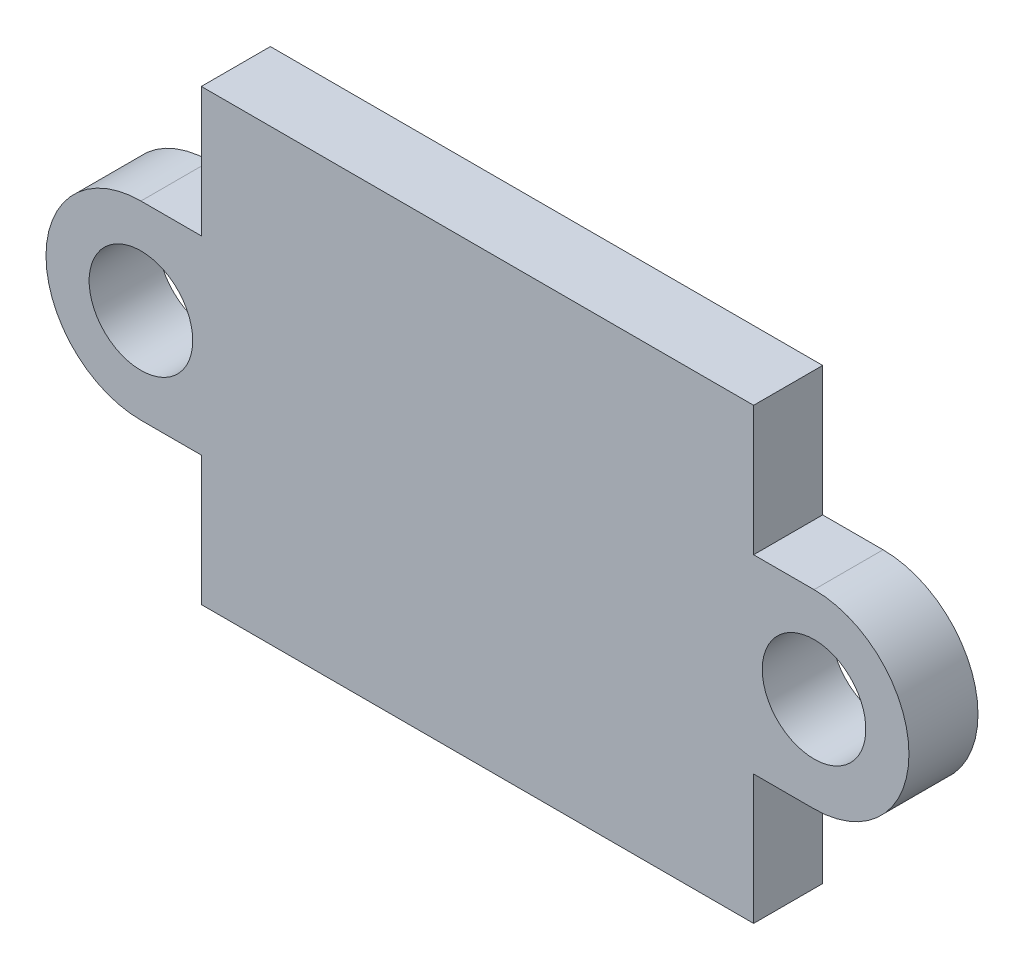
ISO-10303-21;
HEADER;
FILE_DESCRIPTION(('STEP AP214'),'2;1');
FILE_NAME('part.step','',(''),(''),'','','');
FILE_SCHEMA(('AUTOMOTIVE_DESIGN { 1 0 10303 214 1 1 1 1 }'));
ENDSEC;
DATA;
#1=APPLICATION_CONTEXT('core data for automotive mechanical design processes');
#2=APPLICATION_PROTOCOL_DEFINITION('international standard','automotive_design',2000,#1);
#3=PRODUCT_CONTEXT('',#1,'mechanical');
#4=PRODUCT('Part','Part','',(#3));
#5=PRODUCT_RELATED_PRODUCT_CATEGORY('part','',(#4));
#6=PRODUCT_DEFINITION_FORMATION('','',#4);
#7=PRODUCT_DEFINITION_CONTEXT('part definition',#1,'design');
#8=PRODUCT_DEFINITION('design','',#6,#7);
#9=PRODUCT_DEFINITION_SHAPE('','',#8);
#10=(LENGTH_UNIT() NAMED_UNIT(*) SI_UNIT(.MILLI.,.METRE.));
#11=(NAMED_UNIT(*) PLANE_ANGLE_UNIT() SI_UNIT($,.RADIAN.));
#12=(NAMED_UNIT(*) SI_UNIT($,.STERADIAN.) SOLID_ANGLE_UNIT());
#13=UNCERTAINTY_MEASURE_WITH_UNIT(LENGTH_MEASURE(1.E-05),#10,'distance_accuracy_value','');
#14=(GEOMETRIC_REPRESENTATION_CONTEXT(3) GLOBAL_UNCERTAINTY_ASSIGNED_CONTEXT((#13)) GLOBAL_UNIT_ASSIGNED_CONTEXT((#10,
#11,#12)) REPRESENTATION_CONTEXT('',''));
#15=CARTESIAN_POINT('',(0.,0.,0.));
#16=DIRECTION('',(0.,0.,1.));
#17=DIRECTION('',(1.,0.,0.));
#18=AXIS2_PLACEMENT_3D('',#15,#16,#17);
#19=CARTESIAN_POINT('',(-7.99999999999997,-6.50000000000001,1.));
#20=DIRECTION('',(1.,0.,0.));
#21=DIRECTION('',(0.,0.,-1.));
#22=AXIS2_PLACEMENT_3D('',#19,#20,#21);
#23=PLANE('',#22);
#24=DIRECTION('',(0.,0.,-1.));
#25=VECTOR('',#24,1.);
#26=CARTESIAN_POINT('',(-7.99999999999997,2.75,1.));
#27=LINE('',#26,#25);
#28=CARTESIAN_POINT('',(-7.99999999999997,2.75,1.));
#29=VERTEX_POINT('',#28);
#30=CARTESIAN_POINT('',(-7.99999999999997,2.75,-1.));
#31=VERTEX_POINT('',#30);
#32=EDGE_CURVE('E153',#29,#31,#27,.T.);
#33=ORIENTED_EDGE('',*,*,#32,.F.);
#34=DIRECTION('',(0.,-1.,0.));
#35=VECTOR('',#34,1.);
#36=CARTESIAN_POINT('',(-7.99999999999997,-6.50000000000001,1.));
#37=LINE('',#36,#35);
#38=CARTESIAN_POINT('',(-7.99999999999997,6.49999999999998,1.));
#39=VERTEX_POINT('',#38);
#40=EDGE_CURVE('E182',#39,#29,#37,.T.);
#41=ORIENTED_EDGE('',*,*,#40,.F.);
#42=DIRECTION('',(0.,0.,-1.));
#43=VECTOR('',#42,1.);
#44=CARTESIAN_POINT('',(-7.99999999999997,6.49999999999998,1.));
#45=LINE('',#44,#43);
#46=CARTESIAN_POINT('',(-7.99999999999997,6.49999999999998,-1.));
#47=VERTEX_POINT('',#46);
#48=EDGE_CURVE('E193',#39,#47,#45,.T.);
#49=ORIENTED_EDGE('',*,*,#48,.T.);
#50=DIRECTION('',(0.,-1.,0.));
#51=VECTOR('',#50,1.);
#52=CARTESIAN_POINT('',(-7.99999999999997,-6.50000000000001,-1.));
#53=LINE('',#52,#51);
#54=EDGE_CURVE('E194',#47,#31,#53,.T.);
#55=ORIENTED_EDGE('',*,*,#54,.T.);
#56=EDGE_LOOP('',(#33,#41,#49,#55));
#57=FACE_BOUND('',#56,.T.);
#58=ADVANCED_FACE('F36',(#57),#23,.F.);
#59=CARTESIAN_POINT('',(8.00000000000003,-6.50000000000001,1.));
#60=DIRECTION('',(-1.,0.,0.));
#61=DIRECTION('',(0.,0.,1.));
#62=AXIS2_PLACEMENT_3D('',#59,#60,#61);
#63=PLANE('',#62);
#64=DIRECTION('',(0.,0.,-1.));
#65=VECTOR('',#64,1.);
#66=CARTESIAN_POINT('',(7.99999999999997,-2.75,1.));
#67=LINE('',#66,#65);
#68=CARTESIAN_POINT('',(7.99999999999997,-2.75,1.));
#69=VERTEX_POINT('',#68);
#70=CARTESIAN_POINT('',(7.99999999999997,-2.75,-1.));
#71=VERTEX_POINT('',#70);
#72=EDGE_CURVE('E175',#69,#71,#67,.T.);
#73=ORIENTED_EDGE('',*,*,#72,.F.);
#74=DIRECTION('',(0.,1.,0.));
#75=VECTOR('',#74,1.);
#76=CARTESIAN_POINT('',(8.00000000000003,-6.50000000000001,1.));
#77=LINE('',#76,#75);
#78=CARTESIAN_POINT('',(8.00000000000003,-6.50000000000001,1.));
#79=VERTEX_POINT('',#78);
#80=EDGE_CURVE('E188',#79,#69,#77,.T.);
#81=ORIENTED_EDGE('',*,*,#80,.F.);
#82=DIRECTION('',(0.,0.,-1.));
#83=VECTOR('',#82,1.);
#84=CARTESIAN_POINT('',(8.00000000000003,-6.50000000000001,1.));
#85=LINE('',#84,#83);
#86=CARTESIAN_POINT('',(8.00000000000003,-6.50000000000001,-1.));
#87=VERTEX_POINT('',#86);
#88=EDGE_CURVE('E44',#79,#87,#85,.T.);
#89=ORIENTED_EDGE('',*,*,#88,.T.);
#90=DIRECTION('',(0.,1.,0.));
#91=VECTOR('',#90,1.);
#92=CARTESIAN_POINT('',(8.00000000000003,-6.50000000000001,-1.));
#93=LINE('',#92,#91);
#94=EDGE_CURVE('E200',#87,#71,#93,.T.);
#95=ORIENTED_EDGE('',*,*,#94,.T.);
#96=EDGE_LOOP('',(#73,#81,#89,#95));
#97=FACE_BOUND('',#96,.T.);
#98=ADVANCED_FACE('F215',(#97),#63,.F.);
#99=CARTESIAN_POINT('',(-7.99999999999997,-2.75,1.));
#100=VERTEX_POINT('',#99);
#101=CARTESIAN_POINT('',(-7.99999999999997,-6.50000000000001,1.));
#102=VERTEX_POINT('',#101);
#103=EDGE_CURVE('E185',#100,#102,#37,.T.);
#104=ORIENTED_EDGE('',*,*,#103,.F.);
#105=DIRECTION('',(0.,0.,-1.));
#106=VECTOR('',#105,1.);
#107=CARTESIAN_POINT('',(-7.99999999999997,-2.75,1.));
#108=LINE('',#107,#106);
#109=CARTESIAN_POINT('',(-7.99999999999997,-2.75,-1.));
#110=VERTEX_POINT('',#109);
#111=EDGE_CURVE('E130',#100,#110,#108,.T.);
#112=ORIENTED_EDGE('',*,*,#111,.T.);
#113=CARTESIAN_POINT('',(-7.99999999999997,-6.50000000000001,-1.));
#114=VERTEX_POINT('',#113);
#115=EDGE_CURVE('E181',#110,#114,#53,.T.);
#116=ORIENTED_EDGE('',*,*,#115,.T.);
#117=DIRECTION('',(0.,0.,-1.));
#118=VECTOR('',#117,1.);
#119=CARTESIAN_POINT('',(-7.99999999999997,-6.50000000000001,1.));
#120=LINE('',#119,#118);
#121=EDGE_CURVE('E11',#102,#114,#120,.T.);
#122=ORIENTED_EDGE('',*,*,#121,.F.);
#123=EDGE_LOOP('',(#104,#112,#116,#122));
#124=FACE_BOUND('',#123,.T.);
#125=ADVANCED_FACE('F38',(#124),#23,.F.);
#126=CARTESIAN_POINT('',(8.00000000000003,-6.50000000000001,1.));
#127=DIRECTION('',(0.,1.,0.));
#128=DIRECTION('',(0.,0.,1.));
#129=AXIS2_PLACEMENT_3D('',#126,#127,#128);
#130=PLANE('',#129);
#131=DIRECTION('',(1.,0.,0.));
#132=VECTOR('',#131,1.);
#133=CARTESIAN_POINT('',(8.00000000000003,-6.50000000000001,-1.));
#134=LINE('',#133,#132);
#135=EDGE_CURVE('E197',#114,#87,#134,.T.);
#136=ORIENTED_EDGE('',*,*,#135,.T.);
#137=ORIENTED_EDGE('',*,*,#88,.F.);
#138=DIRECTION('',(1.,0.,0.));
#139=VECTOR('',#138,1.);
#140=CARTESIAN_POINT('',(8.00000000000003,-6.50000000000001,1.));
#141=LINE('',#140,#139);
#142=EDGE_CURVE('E184',#102,#79,#141,.T.);
#143=ORIENTED_EDGE('',*,*,#142,.F.);
#144=ORIENTED_EDGE('',*,*,#121,.T.);
#145=EDGE_LOOP('',(#136,#137,#143,#144));
#146=FACE_BOUND('',#145,.T.);
#147=ADVANCED_FACE('F234',(#146),#130,.F.);
#148=CARTESIAN_POINT('',(7.99999999999997,2.75,1.));
#149=VERTEX_POINT('',#148);
#150=CARTESIAN_POINT('',(8.00000000000003,6.49999999999998,1.));
#151=VERTEX_POINT('',#150);
#152=EDGE_CURVE('E187',#149,#151,#77,.T.);
#153=ORIENTED_EDGE('',*,*,#152,.F.);
#154=DIRECTION('',(0.,0.,-1.));
#155=VECTOR('',#154,1.);
#156=CARTESIAN_POINT('',(7.99999999999997,2.75,1.));
#157=LINE('',#156,#155);
#158=CARTESIAN_POINT('',(8.00000000000003,2.75,-1.));
#159=VERTEX_POINT('',#158);
#160=EDGE_CURVE('E177',#149,#159,#157,.T.);
#161=ORIENTED_EDGE('',*,*,#160,.T.);
#162=CARTESIAN_POINT('',(8.00000000000003,6.49999999999998,-1.));
#163=VERTEX_POINT('',#162);
#164=EDGE_CURVE('E199',#159,#163,#93,.T.);
#165=ORIENTED_EDGE('',*,*,#164,.T.);
#166=DIRECTION('',(0.,0.,-1.));
#167=VECTOR('',#166,1.);
#168=CARTESIAN_POINT('',(8.00000000000003,6.49999999999998,1.));
#169=LINE('',#168,#167);
#170=EDGE_CURVE('E207',#151,#163,#169,.T.);
#171=ORIENTED_EDGE('',*,*,#170,.F.);
#172=EDGE_LOOP('',(#153,#161,#165,#171));
#173=FACE_BOUND('',#172,.T.);
#174=ADVANCED_FACE('F258',(#173),#63,.F.);
#175=CARTESIAN_POINT('',(8.00000000000003,6.49999999999998,1.));
#176=DIRECTION('',(0.,-1.,0.));
#177=DIRECTION('',(1.,0.,0.));
#178=AXIS2_PLACEMENT_3D('',#175,#176,#177);
#179=PLANE('',#178);
#180=DIRECTION('',(-1.,0.,0.));
#181=VECTOR('',#180,1.);
#182=CARTESIAN_POINT('',(8.00000000000003,6.49999999999998,-1.));
#183=LINE('',#182,#181);
#184=EDGE_CURVE('E203',#163,#47,#183,.T.);
#185=ORIENTED_EDGE('',*,*,#184,.T.);
#186=ORIENTED_EDGE('',*,*,#48,.F.);
#187=DIRECTION('',(-1.,0.,0.));
#188=VECTOR('',#187,1.);
#189=CARTESIAN_POINT('',(8.00000000000003,6.49999999999998,1.));
#190=LINE('',#189,#188);
#191=EDGE_CURVE('E191',#151,#39,#190,.T.);
#192=ORIENTED_EDGE('',*,*,#191,.F.);
#193=ORIENTED_EDGE('',*,*,#170,.T.);
#194=EDGE_LOOP('',(#185,#186,#192,#193));
#195=FACE_BOUND('',#194,.T.);
#196=ADVANCED_FACE('F253',(#195),#179,.F.);
#197=CARTESIAN_POINT('',(0.,0.,1.));
#198=DIRECTION('',(0.,0.,1.));
#199=DIRECTION('',(1.,0.,0.));
#200=AXIS2_PLACEMENT_3D('',#197,#198,#199);
#201=PLANE('',#200);
#202=ORIENTED_EDGE('',*,*,#40,.T.);
#203=DIRECTION('',(-1.,0.,0.));
#204=VECTOR('',#203,1.);
#205=CARTESIAN_POINT('',(-9.75,2.75,1.));
#206=LINE('',#205,#204);
#207=CARTESIAN_POINT('',(-9.75,2.75,1.));
#208=VERTEX_POINT('',#207);
#209=EDGE_CURVE('E133',#29,#208,#206,.T.);
#210=ORIENTED_EDGE('',*,*,#209,.T.);
#211=CARTESIAN_POINT('',(-9.75,0.,1.));
#212=DIRECTION('',(0.,0.,1.));
#213=DIRECTION('',(1.,0.,0.));
#214=AXIS2_PLACEMENT_3D('',#211,#212,#213);
#215=CIRCLE('',#214,2.75);
#216=CARTESIAN_POINT('',(-9.75,-2.75,1.));
#217=VERTEX_POINT('',#216);
#218=EDGE_CURVE('E134',#208,#217,#215,.T.);
#219=ORIENTED_EDGE('',*,*,#218,.T.);
#220=DIRECTION('',(1.,0.,0.));
#221=VECTOR('',#220,1.);
#222=CARTESIAN_POINT('',(-9.75,-2.75,1.));
#223=LINE('',#222,#221);
#224=EDGE_CURVE('E124',#217,#100,#223,.T.);
#225=ORIENTED_EDGE('',*,*,#224,.T.);
#226=ORIENTED_EDGE('',*,*,#103,.T.);
#227=ORIENTED_EDGE('',*,*,#142,.T.);
#228=ORIENTED_EDGE('',*,*,#80,.T.);
#229=DIRECTION('',(1.,0.,0.));
#230=VECTOR('',#229,1.);
#231=CARTESIAN_POINT('',(9.75,-2.75,1.));
#232=LINE('',#231,#230);
#233=CARTESIAN_POINT('',(9.75,-2.75,1.));
#234=VERTEX_POINT('',#233);
#235=EDGE_CURVE('E166',#69,#234,#232,.T.);
#236=ORIENTED_EDGE('',*,*,#235,.T.);
#237=CARTESIAN_POINT('',(9.75,0.,1.));
#238=DIRECTION('',(0.,0.,1.));
#239=DIRECTION('',(-1.,0.,0.));
#240=AXIS2_PLACEMENT_3D('',#237,#238,#239);
#241=CIRCLE('',#240,2.75);
#242=CARTESIAN_POINT('',(9.75,2.75,1.));
#243=VERTEX_POINT('',#242);
#244=EDGE_CURVE('E160',#234,#243,#241,.T.);
#245=ORIENTED_EDGE('',*,*,#244,.T.);
#246=DIRECTION('',(-1.,0.,0.));
#247=VECTOR('',#246,1.);
#248=CARTESIAN_POINT('',(9.75,2.75,1.));
#249=LINE('',#248,#247);
#250=EDGE_CURVE('E163',#243,#149,#249,.T.);
#251=ORIENTED_EDGE('',*,*,#250,.T.);
#252=ORIENTED_EDGE('',*,*,#152,.T.);
#253=ORIENTED_EDGE('',*,*,#191,.T.);
#254=EDGE_LOOP('',(#202,#210,#219,#225,#226,#227,#228,#236,#245,#251,#252,#253));
#255=FACE_BOUND('',#254,.T.);
#256=CARTESIAN_POINT('',(9.75,0.,1.));
#257=DIRECTION('',(0.,0.,1.));
#258=DIRECTION('',(-1.,0.,0.));
#259=AXIS2_PLACEMENT_3D('',#256,#257,#258);
#260=CIRCLE('',#259,1.5);
#261=CARTESIAN_POINT('',(8.25,0.,1.));
#262=VERTEX_POINT('',#261);
#263=EDGE_CURVE('E151',#262,#262,#260,.T.);
#264=ORIENTED_EDGE('',*,*,#263,.F.);
#265=EDGE_LOOP('',(#264));
#266=FACE_BOUND('',#265,.T.);
#267=CARTESIAN_POINT('',(-9.75,0.,1.));
#268=DIRECTION('',(0.,0.,1.));
#269=DIRECTION('',(1.,0.,0.));
#270=AXIS2_PLACEMENT_3D('',#267,#268,#269);
#271=CIRCLE('',#270,1.5);
#272=CARTESIAN_POINT('',(-8.25,0.,1.));
#273=VERTEX_POINT('',#272);
#274=EDGE_CURVE('E239',#273,#273,#271,.T.);
#275=ORIENTED_EDGE('',*,*,#274,.F.);
#276=EDGE_LOOP('',(#275));
#277=FACE_BOUND('',#276,.T.);
#278=ADVANCED_FACE('F138',(#255,#266,#277),#201,.T.);
#279=CARTESIAN_POINT('',(0.,0.,-1.));
#280=DIRECTION('',(0.,0.,1.));
#281=DIRECTION('',(1.,0.,0.));
#282=AXIS2_PLACEMENT_3D('',#279,#280,#281);
#283=PLANE('',#282);
#284=ORIENTED_EDGE('',*,*,#54,.F.);
#285=ORIENTED_EDGE('',*,*,#184,.F.);
#286=ORIENTED_EDGE('',*,*,#164,.F.);
#287=DIRECTION('',(-1.,0.,0.));
#288=VECTOR('',#287,1.);
#289=CARTESIAN_POINT('',(9.75,2.75,-1.));
#290=LINE('',#289,#288);
#291=CARTESIAN_POINT('',(9.75,2.75,-1.));
#292=VERTEX_POINT('',#291);
#293=EDGE_CURVE('E59',#292,#159,#290,.T.);
#294=ORIENTED_EDGE('',*,*,#293,.F.);
#295=CARTESIAN_POINT('',(9.75,0.,-1.));
#296=DIRECTION('',(0.,0.,1.));
#297=DIRECTION('',(-1.,0.,0.));
#298=AXIS2_PLACEMENT_3D('',#295,#296,#297);
#299=CIRCLE('',#298,2.75);
#300=CARTESIAN_POINT('',(9.75,-2.75,-1.));
#301=VERTEX_POINT('',#300);
#302=EDGE_CURVE('E158',#301,#292,#299,.T.);
#303=ORIENTED_EDGE('',*,*,#302,.F.);
#304=DIRECTION('',(1.,0.,0.));
#305=VECTOR('',#304,1.);
#306=CARTESIAN_POINT('',(9.75,-2.75,-1.));
#307=LINE('',#306,#305);
#308=EDGE_CURVE('E164',#71,#301,#307,.T.);
#309=ORIENTED_EDGE('',*,*,#308,.F.);
#310=ORIENTED_EDGE('',*,*,#94,.F.);
#311=ORIENTED_EDGE('',*,*,#135,.F.);
#312=ORIENTED_EDGE('',*,*,#115,.F.);
#313=DIRECTION('',(1.,0.,0.));
#314=VECTOR('',#313,1.);
#315=CARTESIAN_POINT('',(-9.75,-2.75,-1.));
#316=LINE('',#315,#314);
#317=CARTESIAN_POINT('',(-9.75,-2.75,-1.));
#318=VERTEX_POINT('',#317);
#319=EDGE_CURVE('E51',#318,#110,#316,.T.);
#320=ORIENTED_EDGE('',*,*,#319,.F.);
#321=CARTESIAN_POINT('',(-9.75,0.,-1.));
#322=DIRECTION('',(0.,0.,1.));
#323=DIRECTION('',(1.,0.,0.));
#324=AXIS2_PLACEMENT_3D('',#321,#322,#323);
#325=CIRCLE('',#324,2.75);
#326=CARTESIAN_POINT('',(-9.75,2.75,-1.));
#327=VERTEX_POINT('',#326);
#328=EDGE_CURVE('E147',#327,#318,#325,.T.);
#329=ORIENTED_EDGE('',*,*,#328,.F.);
#330=DIRECTION('',(-1.,0.,0.));
#331=VECTOR('',#330,1.);
#332=CARTESIAN_POINT('',(-9.75,2.75,-1.));
#333=LINE('',#332,#331);
#334=EDGE_CURVE('E143',#31,#327,#333,.T.);
#335=ORIENTED_EDGE('',*,*,#334,.F.);
#336=EDGE_LOOP('',(#284,#285,#286,#294,#303,#309,#310,#311,#312,#320,#329,#335));
#337=FACE_BOUND('',#336,.T.);
#338=CARTESIAN_POINT('',(9.75,0.,-1.));
#339=DIRECTION('',(0.,0.,1.));
#340=DIRECTION('',(-1.,0.,0.));
#341=AXIS2_PLACEMENT_3D('',#338,#339,#340);
#342=CIRCLE('',#341,1.5);
#343=CARTESIAN_POINT('',(8.25,0.,-1.));
#344=VERTEX_POINT('',#343);
#345=EDGE_CURVE('E148',#344,#344,#342,.T.);
#346=ORIENTED_EDGE('',*,*,#345,.T.);
#347=EDGE_LOOP('',(#346));
#348=FACE_BOUND('',#347,.T.);
#349=CARTESIAN_POINT('',(-9.75,0.,-1.));
#350=DIRECTION('',(0.,0.,1.));
#351=DIRECTION('',(1.,0.,0.));
#352=AXIS2_PLACEMENT_3D('',#349,#350,#351);
#353=CIRCLE('',#352,1.5);
#354=CARTESIAN_POINT('',(-8.25,0.,-1.));
#355=VERTEX_POINT('',#354);
#356=EDGE_CURVE('E436',#355,#355,#353,.T.);
#357=ORIENTED_EDGE('',*,*,#356,.T.);
#358=EDGE_LOOP('',(#357));
#359=FACE_BOUND('',#358,.T.);
#360=ADVANCED_FACE('F222',(#337,#348,#359),#283,.F.);
#361=CARTESIAN_POINT('',(9.75,0.,1.));
#362=DIRECTION('',(0.,0.,-1.));
#363=DIRECTION('',(-1.,0.,0.));
#364=AXIS2_PLACEMENT_3D('',#361,#362,#363);
#365=CYLINDRICAL_SURFACE('',#364,2.75);
#366=ORIENTED_EDGE('',*,*,#302,.T.);
#367=DIRECTION('',(0.,0.,-1.));
#368=VECTOR('',#367,1.);
#369=CARTESIAN_POINT('',(9.75,2.75,1.));
#370=LINE('',#369,#368);
#371=EDGE_CURVE('E179',#243,#292,#370,.T.);
#372=ORIENTED_EDGE('',*,*,#371,.F.);
#373=ORIENTED_EDGE('',*,*,#244,.F.);
#374=DIRECTION('',(0.,0.,-1.));
#375=VECTOR('',#374,1.);
#376=CARTESIAN_POINT('',(9.75,-2.75,1.));
#377=LINE('',#376,#375);
#378=EDGE_CURVE('E168',#234,#301,#377,.T.);
#379=ORIENTED_EDGE('',*,*,#378,.T.);
#380=EDGE_LOOP('',(#366,#372,#373,#379));
#381=FACE_BOUND('',#380,.T.);
#382=ADVANCED_FACE('F231',(#381),#365,.T.);
#383=CARTESIAN_POINT('',(9.75,2.75,1.));
#384=DIRECTION('',(0.,-1.,0.));
#385=DIRECTION('',(1.,0.,0.));
#386=AXIS2_PLACEMENT_3D('',#383,#384,#385);
#387=PLANE('',#386);
#388=ORIENTED_EDGE('',*,*,#293,.T.);
#389=ORIENTED_EDGE('',*,*,#160,.F.);
#390=ORIENTED_EDGE('',*,*,#250,.F.);
#391=ORIENTED_EDGE('',*,*,#371,.T.);
#392=EDGE_LOOP('',(#388,#389,#390,#391));
#393=FACE_BOUND('',#392,.T.);
#394=ADVANCED_FACE('F259',(#393),#387,.F.);
#395=CARTESIAN_POINT('',(9.75,-2.75,1.));
#396=DIRECTION('',(0.,1.,0.));
#397=DIRECTION('',(-1.,0.,0.));
#398=AXIS2_PLACEMENT_3D('',#395,#396,#397);
#399=PLANE('',#398);
#400=ORIENTED_EDGE('',*,*,#308,.T.);
#401=ORIENTED_EDGE('',*,*,#378,.F.);
#402=ORIENTED_EDGE('',*,*,#235,.F.);
#403=ORIENTED_EDGE('',*,*,#72,.T.);
#404=EDGE_LOOP('',(#400,#401,#402,#403));
#405=FACE_BOUND('',#404,.T.);
#406=ADVANCED_FACE('F228',(#405),#399,.F.);
#407=CARTESIAN_POINT('',(9.75,0.,1.));
#408=DIRECTION('',(0.,0.,-1.));
#409=DIRECTION('',(-1.,0.,0.));
#410=AXIS2_PLACEMENT_3D('',#407,#408,#409);
#411=CYLINDRICAL_SURFACE('',#410,1.5);
#412=ORIENTED_EDGE('',*,*,#263,.T.);
#413=EDGE_LOOP('',(#412));
#414=FACE_BOUND('',#413,.T.);
#415=ORIENTED_EDGE('',*,*,#345,.F.);
#416=EDGE_LOOP('',(#415));
#417=FACE_BOUND('',#416,.T.);
#418=ADVANCED_FACE('F266',(#414,#417),#411,.F.);
#419=CARTESIAN_POINT('',(-9.75,0.,1.));
#420=DIRECTION('',(0.,0.,-1.));
#421=DIRECTION('',(-1.,0.,0.));
#422=AXIS2_PLACEMENT_3D('',#419,#420,#421);
#423=CYLINDRICAL_SURFACE('',#422,2.75);
#424=ORIENTED_EDGE('',*,*,#328,.T.);
#425=DIRECTION('',(0.,0.,-1.));
#426=VECTOR('',#425,1.);
#427=CARTESIAN_POINT('',(-9.75,-2.75,1.));
#428=LINE('',#427,#426);
#429=EDGE_CURVE('E128',#217,#318,#428,.T.);
#430=ORIENTED_EDGE('',*,*,#429,.F.);
#431=ORIENTED_EDGE('',*,*,#218,.F.);
#432=DIRECTION('',(0.,0.,-1.));
#433=VECTOR('',#432,1.);
#434=CARTESIAN_POINT('',(-9.75,2.75,1.));
#435=LINE('',#434,#433);
#436=EDGE_CURVE('E243',#208,#327,#435,.T.);
#437=ORIENTED_EDGE('',*,*,#436,.T.);
#438=EDGE_LOOP('',(#424,#430,#431,#437));
#439=FACE_BOUND('',#438,.T.);
#440=ADVANCED_FACE('F145',(#439),#423,.T.);
#441=CARTESIAN_POINT('',(-9.75,-2.75,1.));
#442=DIRECTION('',(0.,1.,0.));
#443=DIRECTION('',(-1.,0.,0.));
#444=AXIS2_PLACEMENT_3D('',#441,#442,#443);
#445=PLANE('',#444);
#446=ORIENTED_EDGE('',*,*,#319,.T.);
#447=ORIENTED_EDGE('',*,*,#111,.F.);
#448=ORIENTED_EDGE('',*,*,#224,.F.);
#449=ORIENTED_EDGE('',*,*,#429,.T.);
#450=EDGE_LOOP('',(#446,#447,#448,#449));
#451=FACE_BOUND('',#450,.T.);
#452=ADVANCED_FACE('F126',(#451),#445,.F.);
#453=CARTESIAN_POINT('',(-9.75,2.75,1.));
#454=DIRECTION('',(0.,-1.,0.));
#455=DIRECTION('',(1.,0.,0.));
#456=AXIS2_PLACEMENT_3D('',#453,#454,#455);
#457=PLANE('',#456);
#458=ORIENTED_EDGE('',*,*,#334,.T.);
#459=ORIENTED_EDGE('',*,*,#436,.F.);
#460=ORIENTED_EDGE('',*,*,#209,.F.);
#461=ORIENTED_EDGE('',*,*,#32,.T.);
#462=EDGE_LOOP('',(#458,#459,#460,#461));
#463=FACE_BOUND('',#462,.T.);
#464=ADVANCED_FACE('F246',(#463),#457,.F.);
#465=CARTESIAN_POINT('',(-9.75,0.,1.));
#466=DIRECTION('',(0.,0.,-1.));
#467=DIRECTION('',(-1.,0.,0.));
#468=AXIS2_PLACEMENT_3D('',#465,#466,#467);
#469=CYLINDRICAL_SURFACE('',#468,1.5);
#470=ORIENTED_EDGE('',*,*,#274,.T.);
#471=EDGE_LOOP('',(#470));
#472=FACE_BOUND('',#471,.T.);
#473=ORIENTED_EDGE('',*,*,#356,.F.);
#474=EDGE_LOOP('',(#473));
#475=FACE_BOUND('',#474,.T.);
#476=ADVANCED_FACE('F353',(#472,#475),#469,.F.);
#477=CLOSED_SHELL('',(#58,#98,#125,#147,#174,#196,#278,#360,#382,#394,#406,#418,#440,#452,#464,#476));
#478=MANIFOLD_SOLID_BREP('B2',#477);
#479=ADVANCED_BREP_SHAPE_REPRESENTATION('',(#18,#478),#14);
#480=SHAPE_DEFINITION_REPRESENTATION(#9,#479);
ENDSEC;
END-ISO-10303-21;
